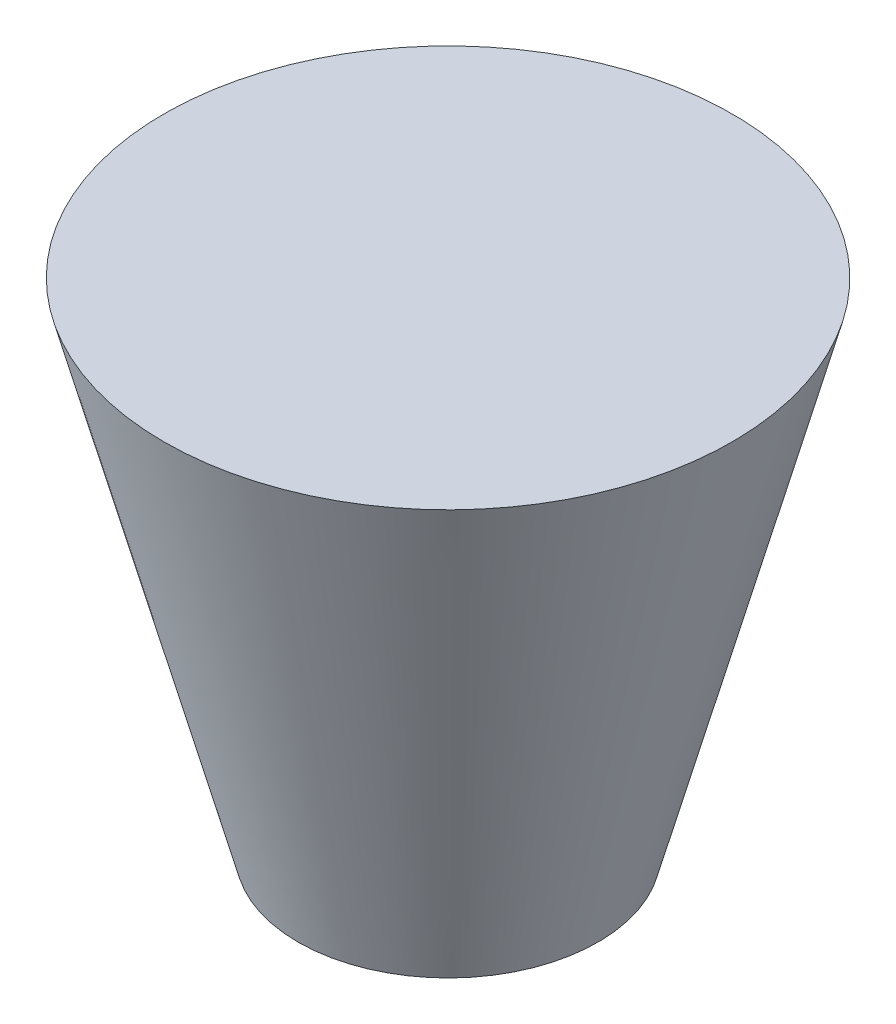
ISO-10303-21;
HEADER;
FILE_DESCRIPTION(('STEP AP214'),'2;1');
FILE_NAME('part.step','',(''),(''),'','','');
FILE_SCHEMA(('AUTOMOTIVE_DESIGN { 1 0 10303 214 1 1 1 1 }'));
ENDSEC;
DATA;
#1=APPLICATION_CONTEXT('core data for automotive mechanical design processes');
#2=APPLICATION_PROTOCOL_DEFINITION('international standard','automotive_design',2000,#1);
#3=PRODUCT_CONTEXT('',#1,'mechanical');
#4=PRODUCT('Part','Part','',(#3));
#5=PRODUCT_RELATED_PRODUCT_CATEGORY('part','',(#4));
#6=PRODUCT_DEFINITION_FORMATION('','',#4);
#7=PRODUCT_DEFINITION_CONTEXT('part definition',#1,'design');
#8=PRODUCT_DEFINITION('design','',#6,#7);
#9=PRODUCT_DEFINITION_SHAPE('','',#8);
#10=(LENGTH_UNIT() NAMED_UNIT(*) SI_UNIT(.MILLI.,.METRE.));
#11=(NAMED_UNIT(*) PLANE_ANGLE_UNIT() SI_UNIT($,.RADIAN.));
#12=(NAMED_UNIT(*) SI_UNIT($,.STERADIAN.) SOLID_ANGLE_UNIT());
#13=UNCERTAINTY_MEASURE_WITH_UNIT(LENGTH_MEASURE(1.E-05),#10,'distance_accuracy_value','');
#14=(GEOMETRIC_REPRESENTATION_CONTEXT(3) GLOBAL_UNCERTAINTY_ASSIGNED_CONTEXT((#13)) GLOBAL_UNIT_ASSIGNED_CONTEXT((#10,
#11,#12)) REPRESENTATION_CONTEXT('',''));
#15=CARTESIAN_POINT('',(0.,0.,0.));
#16=DIRECTION('',(0.,0.,1.));
#17=DIRECTION('',(1.,0.,0.));
#18=AXIS2_PLACEMENT_3D('',#15,#16,#17);
#19=CARTESIAN_POINT('',(-23.5031559635927,0.,-13.3913330490238));
#20=DIRECTION('',(0.,1.,0.));
#21=DIRECTION('',(0.,0.,1.));
#22=AXIS2_PLACEMENT_3D('',#19,#20,#21);
#23=CONICAL_SURFACE('',#22,150.,0.261799387799149);
#24=CARTESIAN_POINT('',(-23.5031559635927,500.,-13.3913330490238));
#25=DIRECTION('',(0.,1.,0.));
#26=DIRECTION('',(0.,0.,1.));
#27=AXIS2_PLACEMENT_3D('',#24,#25,#26);
#28=CIRCLE('',#27,283.974596215561);
#29=CARTESIAN_POINT('',(-23.5031559635927,500.,270.583263166538));
#30=VERTEX_POINT('',#29);
#31=EDGE_CURVE('E10',#30,#30,#28,.T.);
#32=ORIENTED_EDGE('',*,*,#31,.F.);
#33=EDGE_LOOP('',(#32));
#34=FACE_BOUND('',#33,.T.);
#35=CARTESIAN_POINT('',(-23.5031559635927,0.,-13.3913330490238));
#36=DIRECTION('',(0.,1.,0.));
#37=DIRECTION('',(0.,0.,1.));
#38=AXIS2_PLACEMENT_3D('',#35,#36,#37);
#39=CIRCLE('',#38,150.);
#40=CARTESIAN_POINT('',(-23.5031559635927,0.,136.608666950976));
#41=VERTEX_POINT('',#40);
#42=EDGE_CURVE('E44',#41,#41,#39,.T.);
#43=ORIENTED_EDGE('',*,*,#42,.T.);
#44=EDGE_LOOP('',(#43));
#45=FACE_BOUND('',#44,.T.);
#46=ADVANCED_FACE('F37',(#34,#45),#23,.T.);
#47=CARTESIAN_POINT('',(-23.5031559635927,500.,-13.3913330490238));
#48=DIRECTION('',(0.,1.,0.));
#49=DIRECTION('',(0.,0.,1.));
#50=AXIS2_PLACEMENT_3D('',#47,#48,#49);
#51=PLANE('',#50);
#52=ORIENTED_EDGE('',*,*,#31,.T.);
#53=EDGE_LOOP('',(#52));
#54=FACE_BOUND('',#53,.T.);
#55=ADVANCED_FACE('F54',(#54),#51,.T.);
#56=CARTESIAN_POINT('',(-23.5031559635927,0.,-13.3913330490238));
#57=DIRECTION('',(0.,1.,0.));
#58=DIRECTION('',(0.,0.,1.));
#59=AXIS2_PLACEMENT_3D('',#56,#57,#58);
#60=PLANE('',#59);
#61=ORIENTED_EDGE('',*,*,#42,.F.);
#62=EDGE_LOOP('',(#61));
#63=FACE_BOUND('',#62,.T.);
#64=ADVANCED_FACE('F52',(#63),#60,.F.);
#65=CLOSED_SHELL('',(#46,#55,#64));
#66=MANIFOLD_SOLID_BREP('B2',#65);
#67=ADVANCED_BREP_SHAPE_REPRESENTATION('',(#18,#66),#14);
#68=SHAPE_DEFINITION_REPRESENTATION(#9,#67);
ENDSEC;
END-ISO-10303-21;
